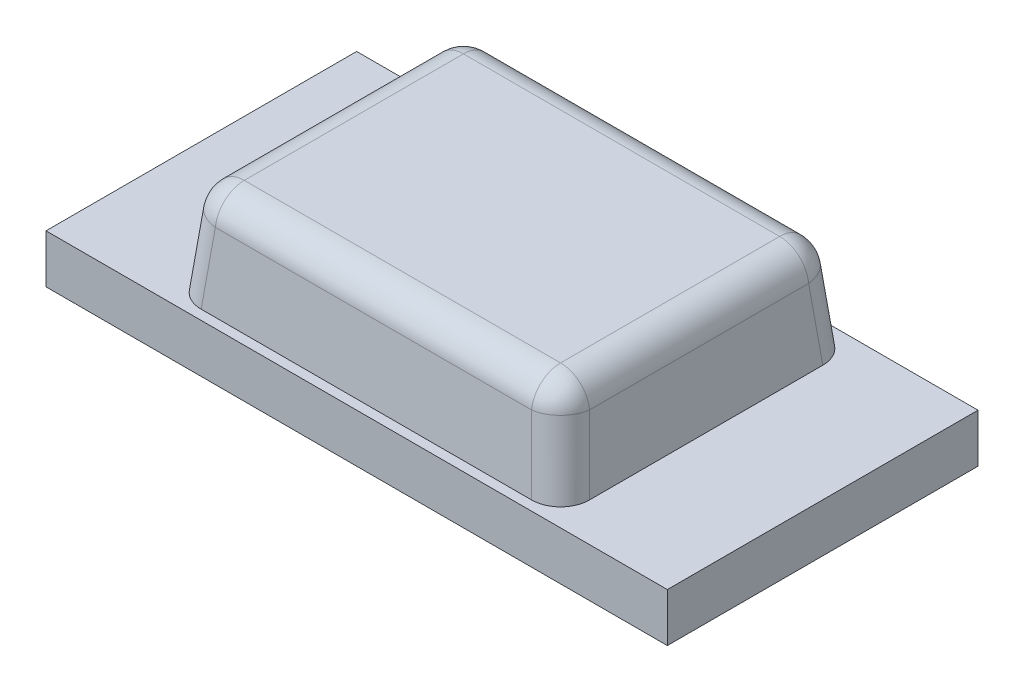
ISO-10303-21;
HEADER;
FILE_DESCRIPTION(('STEP AP214'),'2;1');
FILE_NAME('part.step','',(''),(''),'','','');
FILE_SCHEMA(('AUTOMOTIVE_DESIGN { 1 0 10303 214 1 1 1 1 }'));
ENDSEC;
DATA;
#1=APPLICATION_CONTEXT('core data for automotive mechanical design processes');
#2=APPLICATION_PROTOCOL_DEFINITION('international standard','automotive_design',2000,#1);
#3=PRODUCT_CONTEXT('',#1,'mechanical');
#4=PRODUCT('Part','Part','',(#3));
#5=PRODUCT_RELATED_PRODUCT_CATEGORY('part','',(#4));
#6=PRODUCT_DEFINITION_FORMATION('','',#4);
#7=PRODUCT_DEFINITION_CONTEXT('part definition',#1,'design');
#8=PRODUCT_DEFINITION('design','',#6,#7);
#9=PRODUCT_DEFINITION_SHAPE('','',#8);
#10=(LENGTH_UNIT() NAMED_UNIT(*) SI_UNIT(.MILLI.,.METRE.));
#11=(NAMED_UNIT(*) PLANE_ANGLE_UNIT() SI_UNIT($,.RADIAN.));
#12=(NAMED_UNIT(*) SI_UNIT($,.STERADIAN.) SOLID_ANGLE_UNIT());
#13=UNCERTAINTY_MEASURE_WITH_UNIT(LENGTH_MEASURE(1.E-05),#10,'distance_accuracy_value','');
#14=(GEOMETRIC_REPRESENTATION_CONTEXT(3) GLOBAL_UNCERTAINTY_ASSIGNED_CONTEXT((#13)) GLOBAL_UNIT_ASSIGNED_CONTEXT((#10,
#11,#12)) REPRESENTATION_CONTEXT('',''));
#15=CARTESIAN_POINT('',(0.,0.,0.));
#16=DIRECTION('',(0.,0.,1.));
#17=DIRECTION('',(1.,0.,0.));
#18=AXIS2_PLACEMENT_3D('',#15,#16,#17);
#19=CARTESIAN_POINT('',(0.,0.25,0.));
#20=DIRECTION('',(0.,-1.,0.));
#21=DIRECTION('',(0.,0.,-1.));
#22=AXIS2_PLACEMENT_3D('',#19,#20,#21);
#23=PLANE('',#22);
#24=DIRECTION('',(0.,0.,-1.));
#25=VECTOR('',#24,1.);
#26=CARTESIAN_POINT('',(1.6,0.25,0.799999999999998));
#27=LINE('',#26,#25);
#28=CARTESIAN_POINT('',(1.6,0.25,0.799999999999998));
#29=VERTEX_POINT('',#28);
#30=CARTESIAN_POINT('',(1.6,0.25,-0.800000000000002));
#31=VERTEX_POINT('',#30);
#32=EDGE_CURVE('E147',#29,#31,#27,.T.);
#33=ORIENTED_EDGE('',*,*,#32,.T.);
#34=DIRECTION('',(-1.,0.,0.));
#35=VECTOR('',#34,1.);
#36=CARTESIAN_POINT('',(-1.6,0.25,-0.800000000000002));
#37=LINE('',#36,#35);
#38=CARTESIAN_POINT('',(-1.6,0.25,-0.800000000000002));
#39=VERTEX_POINT('',#38);
#40=EDGE_CURVE('E136',#31,#39,#37,.T.);
#41=ORIENTED_EDGE('',*,*,#40,.T.);
#42=DIRECTION('',(0.,0.,1.));
#43=VECTOR('',#42,1.);
#44=CARTESIAN_POINT('',(-1.6,0.25,0.799999999999998));
#45=LINE('',#44,#43);
#46=CARTESIAN_POINT('',(-1.6,0.25,0.799999999999998));
#47=VERTEX_POINT('',#46);
#48=EDGE_CURVE('E146',#39,#47,#45,.T.);
#49=ORIENTED_EDGE('',*,*,#48,.T.);
#50=DIRECTION('',(1.,0.,0.));
#51=VECTOR('',#50,1.);
#52=CARTESIAN_POINT('',(-1.6,0.25,0.799999999999998));
#53=LINE('',#52,#51);
#54=EDGE_CURVE('E152',#47,#29,#53,.T.);
#55=ORIENTED_EDGE('',*,*,#54,.T.);
#56=EDGE_LOOP('',(#33,#41,#49,#55));
#57=FACE_BOUND('',#56,.T.);
#58=DIRECTION('',(0.,0.,-1.));
#59=VECTOR('',#58,1.);
#60=CARTESIAN_POINT('',(1.,0.25,0.750000000000002));
#61=LINE('',#60,#59);
#62=CARTESIAN_POINT('',(1.,0.25,0.600744266964108));
#63=VERTEX_POINT('',#62);
#64=CARTESIAN_POINT('',(1.,0.25,-0.600744266964107));
#65=VERTEX_POINT('',#64);
#66=EDGE_CURVE('E236',#63,#65,#61,.T.);
#67=ORIENTED_EDGE('',*,*,#66,.F.);
#68=CARTESIAN_POINT('',(0.849252021732466,0.25,0.599252021732468));
#69=DIRECTION('',(0.,-1.,0.));
#70=DIRECTION('',(0.707106781186548,0.,0.707106781186548));
#71=AXIS2_PLACEMENT_3D('',#68,#69,#70);
#72=ELLIPSE('',#71,0.151492263510379,0.15);
#73=CARTESIAN_POINT('',(0.850744266964105,0.25,0.750000000000002));
#74=VERTEX_POINT('',#73);
#75=EDGE_CURVE('E43',#63,#74,#72,.T.);
#76=ORIENTED_EDGE('',*,*,#75,.T.);
#77=DIRECTION('',(1.,0.,0.));
#78=VECTOR('',#77,1.);
#79=CARTESIAN_POINT('',(-1.,0.25,0.750000000000002));
#80=LINE('',#79,#78);
#81=CARTESIAN_POINT('',(-0.850744266964105,0.25,0.750000000000002));
#82=VERTEX_POINT('',#81);
#83=EDGE_CURVE('E247',#82,#74,#80,.T.);
#84=ORIENTED_EDGE('',*,*,#83,.F.);
#85=CARTESIAN_POINT('',(-0.849252021732466,0.25,0.599252021732468));
#86=DIRECTION('',(0.,-1.,0.));
#87=DIRECTION('',(-0.707106781186548,0.,0.707106781186548));
#88=AXIS2_PLACEMENT_3D('',#85,#86,#87);
#89=ELLIPSE('',#88,0.151492263510379,0.15);
#90=CARTESIAN_POINT('',(-1.,0.25,0.600744266964108));
#91=VERTEX_POINT('',#90);
#92=EDGE_CURVE('E11',#82,#91,#89,.T.);
#93=ORIENTED_EDGE('',*,*,#92,.T.);
#94=DIRECTION('',(0.,0.,1.));
#95=VECTOR('',#94,1.);
#96=CARTESIAN_POINT('',(-1.,0.25,0.750000000000002));
#97=LINE('',#96,#95);
#98=CARTESIAN_POINT('',(-1.,0.25,-0.600744266964107));
#99=VERTEX_POINT('',#98);
#100=EDGE_CURVE('E242',#99,#91,#97,.T.);
#101=ORIENTED_EDGE('',*,*,#100,.F.);
#102=CARTESIAN_POINT('',(-0.849252021732466,0.25,-0.599252021732468));
#103=DIRECTION('',(0.,-1.,0.));
#104=DIRECTION('',(-0.707106781186548,0.,-0.707106781186548));
#105=AXIS2_PLACEMENT_3D('',#102,#103,#104);
#106=ELLIPSE('',#105,0.151492263510379,0.15);
#107=CARTESIAN_POINT('',(-0.850744266964105,0.25,-0.750000000000002));
#108=VERTEX_POINT('',#107);
#109=EDGE_CURVE('E198',#99,#108,#106,.T.);
#110=ORIENTED_EDGE('',*,*,#109,.T.);
#111=DIRECTION('',(-1.,0.,0.));
#112=VECTOR('',#111,1.);
#113=CARTESIAN_POINT('',(-1.,0.25,-0.750000000000002));
#114=LINE('',#113,#112);
#115=CARTESIAN_POINT('',(0.850744266964105,0.25,-0.750000000000002));
#116=VERTEX_POINT('',#115);
#117=EDGE_CURVE('E238',#116,#108,#114,.T.);
#118=ORIENTED_EDGE('',*,*,#117,.F.);
#119=CARTESIAN_POINT('',(0.849252021732466,0.25,-0.599252021732468));
#120=DIRECTION('',(0.,-1.,0.));
#121=DIRECTION('',(0.707106781186548,0.,-0.707106781186548));
#122=AXIS2_PLACEMENT_3D('',#119,#120,#121);
#123=ELLIPSE('',#122,0.151492263510379,0.15);
#124=EDGE_CURVE('E200',#116,#65,#123,.T.);
#125=ORIENTED_EDGE('',*,*,#124,.T.);
#126=EDGE_LOOP('',(#67,#76,#84,#93,#101,#110,#118,#125));
#127=FACE_BOUND('',#126,.T.);
#128=ADVANCED_FACE('F34',(#57,#127),#23,.F.);
#129=CARTESIAN_POINT('',(1.6,0.25,0.799999999999998));
#130=DIRECTION('',(-1.,0.,0.));
#131=DIRECTION('',(0.,0.,1.));
#132=AXIS2_PLACEMENT_3D('',#129,#130,#131);
#133=PLANE('',#132);
#134=DIRECTION('',(0.,0.,-1.));
#135=VECTOR('',#134,1.);
#136=CARTESIAN_POINT('',(1.6,0.,0.799999999999998));
#137=LINE('',#136,#135);
#138=CARTESIAN_POINT('',(1.6,0.,0.799999999999998));
#139=VERTEX_POINT('',#138);
#140=CARTESIAN_POINT('',(1.6,0.,-0.800000000000002));
#141=VERTEX_POINT('',#140);
#142=EDGE_CURVE('E160',#139,#141,#137,.T.);
#143=ORIENTED_EDGE('',*,*,#142,.T.);
#144=DIRECTION('',(0.,-1.,0.));
#145=VECTOR('',#144,1.);
#146=CARTESIAN_POINT('',(1.6,0.25,-0.800000000000002));
#147=LINE('',#146,#145);
#148=EDGE_CURVE('E140',#31,#141,#147,.T.);
#149=ORIENTED_EDGE('',*,*,#148,.F.);
#150=ORIENTED_EDGE('',*,*,#32,.F.);
#151=DIRECTION('',(0.,-1.,0.));
#152=VECTOR('',#151,1.);
#153=CARTESIAN_POINT('',(1.6,0.25,0.799999999999998));
#154=LINE('',#153,#152);
#155=EDGE_CURVE('E252',#29,#139,#154,.T.);
#156=ORIENTED_EDGE('',*,*,#155,.T.);
#157=EDGE_LOOP('',(#143,#149,#150,#156));
#158=FACE_BOUND('',#157,.T.);
#159=ADVANCED_FACE('F158',(#158),#133,.F.);
#160=CARTESIAN_POINT('',(-1.6,0.25,-0.800000000000002));
#161=DIRECTION('',(0.,0.,1.));
#162=DIRECTION('',(1.,0.,0.));
#163=AXIS2_PLACEMENT_3D('',#160,#161,#162);
#164=PLANE('',#163);
#165=DIRECTION('',(-1.,0.,0.));
#166=VECTOR('',#165,1.);
#167=CARTESIAN_POINT('',(-1.6,0.,-0.800000000000002));
#168=LINE('',#167,#166);
#169=CARTESIAN_POINT('',(-1.6,0.,-0.800000000000002));
#170=VERTEX_POINT('',#169);
#171=EDGE_CURVE('E254',#141,#170,#168,.T.);
#172=ORIENTED_EDGE('',*,*,#171,.T.);
#173=DIRECTION('',(0.,-1.,0.));
#174=VECTOR('',#173,1.);
#175=CARTESIAN_POINT('',(-1.6,0.25,-0.800000000000002));
#176=LINE('',#175,#174);
#177=EDGE_CURVE('E143',#39,#170,#176,.T.);
#178=ORIENTED_EDGE('',*,*,#177,.F.);
#179=ORIENTED_EDGE('',*,*,#40,.F.);
#180=ORIENTED_EDGE('',*,*,#148,.T.);
#181=EDGE_LOOP('',(#172,#178,#179,#180));
#182=FACE_BOUND('',#181,.T.);
#183=ADVANCED_FACE('F138',(#182),#164,.F.);
#184=CARTESIAN_POINT('',(-1.6,0.25,0.799999999999998));
#185=DIRECTION('',(1.,0.,0.));
#186=DIRECTION('',(0.,0.,-1.));
#187=AXIS2_PLACEMENT_3D('',#184,#185,#186);
#188=PLANE('',#187);
#189=DIRECTION('',(0.,0.,1.));
#190=VECTOR('',#189,1.);
#191=CARTESIAN_POINT('',(-1.6,0.,0.799999999999998));
#192=LINE('',#191,#190);
#193=CARTESIAN_POINT('',(-1.6,0.,0.799999999999998));
#194=VERTEX_POINT('',#193);
#195=EDGE_CURVE('E256',#170,#194,#192,.T.);
#196=ORIENTED_EDGE('',*,*,#195,.T.);
#197=DIRECTION('',(0.,-1.,0.));
#198=VECTOR('',#197,1.);
#199=CARTESIAN_POINT('',(-1.6,0.25,0.799999999999998));
#200=LINE('',#199,#198);
#201=EDGE_CURVE('E165',#47,#194,#200,.T.);
#202=ORIENTED_EDGE('',*,*,#201,.F.);
#203=ORIENTED_EDGE('',*,*,#48,.F.);
#204=ORIENTED_EDGE('',*,*,#177,.T.);
#205=EDGE_LOOP('',(#196,#202,#203,#204));
#206=FACE_BOUND('',#205,.T.);
#207=ADVANCED_FACE('F268',(#206),#188,.F.);
#208=CARTESIAN_POINT('',(-1.6,0.25,0.799999999999998));
#209=DIRECTION('',(0.,0.,-1.));
#210=DIRECTION('',(-1.,0.,0.));
#211=AXIS2_PLACEMENT_3D('',#208,#209,#210);
#212=PLANE('',#211);
#213=DIRECTION('',(1.,0.,0.));
#214=VECTOR('',#213,1.);
#215=CARTESIAN_POINT('',(-1.6,0.,0.799999999999998));
#216=LINE('',#215,#214);
#217=EDGE_CURVE('E156',#194,#139,#216,.T.);
#218=ORIENTED_EDGE('',*,*,#217,.T.);
#219=ORIENTED_EDGE('',*,*,#155,.F.);
#220=ORIENTED_EDGE('',*,*,#54,.F.);
#221=ORIENTED_EDGE('',*,*,#201,.T.);
#222=EDGE_LOOP('',(#218,#219,#220,#221));
#223=FACE_BOUND('',#222,.T.);
#224=ADVANCED_FACE('F263',(#223),#212,.F.);
#225=CARTESIAN_POINT('',(0.,0.,0.));
#226=DIRECTION('',(0.,-1.,0.));
#227=DIRECTION('',(0.,0.,-1.));
#228=AXIS2_PLACEMENT_3D('',#225,#226,#227);
#229=PLANE('',#228);
#230=ORIENTED_EDGE('',*,*,#142,.F.);
#231=ORIENTED_EDGE('',*,*,#217,.F.);
#232=ORIENTED_EDGE('',*,*,#195,.F.);
#233=ORIENTED_EDGE('',*,*,#171,.F.);
#234=EDGE_LOOP('',(#230,#231,#232,#233));
#235=FACE_BOUND('',#234,.T.);
#236=ADVANCED_FACE('F267',(#235),#229,.T.);
#237=CARTESIAN_POINT('',(1.,0.25,0.750000000000002));
#238=DIRECTION('',(0.995038220239298,0.0994934181893926,0.));
#239=DIRECTION('',(-0.0994934181893926,0.995038220239299,0.));
#240=AXIS2_PLACEMENT_3D('',#237,#238,#239);
#241=PLANE('',#240);
#242=ORIENTED_EDGE('',*,*,#66,.T.);
#243=DIRECTION('',(-0.0990046045615373,0.990149572817778,0.0990046045615372));
#244=VECTOR('',#243,1.);
#245=CARTESIAN_POINT('',(0.986760123932997,0.382412605352665,-0.587504390897104));
#246=LINE('',#245,#244);
#247=CARTESIAN_POINT('',(0.96351141426808,0.614924012728409,-0.564255681232188));
#248=VERTEX_POINT('',#247);
#249=EDGE_CURVE('E51',#65,#248,#246,.T.);
#250=ORIENTED_EDGE('',*,*,#249,.T.);
#251=DIRECTION('',(0.,0.,-1.));
#252=VECTOR('',#251,1.);
#253=CARTESIAN_POINT('',(0.96351141426808,0.614924012728409,0.750000000000002));
#254=LINE('',#253,#252);
#255=CARTESIAN_POINT('',(0.96351141426808,0.614924012728409,0.564255681232188));
#256=VERTEX_POINT('',#255);
#257=EDGE_CURVE('E56',#248,#256,#254,.F.);
#258=ORIENTED_EDGE('',*,*,#257,.T.);
#259=DIRECTION('',(-0.0990046045615373,0.990149572817778,-0.0990046045615372));
#260=VECTOR('',#259,1.);
#261=CARTESIAN_POINT('',(1.00146299151958,0.235368554982266,0.602207258483684));
#262=LINE('',#261,#260);
#263=EDGE_CURVE('E194',#256,#63,#262,.F.);
#264=ORIENTED_EDGE('',*,*,#263,.T.);
#265=EDGE_LOOP('',(#242,#250,#258,#264));
#266=FACE_BOUND('',#265,.T.);
#267=ADVANCED_FACE('F288',(#266),#241,.T.);
#268=CARTESIAN_POINT('',(-1.,0.25,-0.750000000000002));
#269=DIRECTION('',(0.,0.0994934181893926,-0.995038220239298));
#270=DIRECTION('',(0.,0.995038220239299,0.0994934181893926));
#271=AXIS2_PLACEMENT_3D('',#268,#269,#270);
#272=PLANE('',#271);
#273=ORIENTED_EDGE('',*,*,#117,.T.);
#274=DIRECTION('',(0.0990046045615372,0.990149572817778,0.0990046045615372));
#275=VECTOR('',#274,1.);
#276=CARTESIAN_POINT('',(-0.852207258483682,0.235368554982266,-0.751462991519579));
#277=LINE('',#276,#275);
#278=CARTESIAN_POINT('',(-0.814255681232185,0.614924012728409,-0.713511414268082));
#279=VERTEX_POINT('',#278);
#280=EDGE_CURVE('E192',#108,#279,#277,.T.);
#281=ORIENTED_EDGE('',*,*,#280,.T.);
#282=DIRECTION('',(-1.,0.,0.));
#283=VECTOR('',#282,1.);
#284=CARTESIAN_POINT('',(-1.,0.614924012728409,-0.713511414268082));
#285=LINE('',#284,#283);
#286=CARTESIAN_POINT('',(0.814255681232186,0.614924012728409,-0.713511414268082));
#287=VERTEX_POINT('',#286);
#288=EDGE_CURVE('E190',#279,#287,#285,.F.);
#289=ORIENTED_EDGE('',*,*,#288,.T.);
#290=DIRECTION('',(-0.0990046045615372,0.990149572817778,0.0990046045615372));
#291=VECTOR('',#290,1.);
#292=CARTESIAN_POINT('',(0.832603435034909,0.431427288809464,-0.731859168070806));
#293=LINE('',#292,#291);
#294=EDGE_CURVE('E188',#287,#116,#293,.F.);
#295=ORIENTED_EDGE('',*,*,#294,.T.);
#296=EDGE_LOOP('',(#273,#281,#289,#295));
#297=FACE_BOUND('',#296,.T.);
#298=ADVANCED_FACE('F285',(#297),#272,.T.);
#299=CARTESIAN_POINT('',(-1.,0.25,0.750000000000002));
#300=DIRECTION('',(-0.995038220239298,0.0994934181893926,0.));
#301=DIRECTION('',(-0.0994934181893926,-0.995038220239299,0.));
#302=AXIS2_PLACEMENT_3D('',#299,#300,#301);
#303=PLANE('',#302);
#304=DIRECTION('',(0.,0.,1.));
#305=VECTOR('',#304,1.);
#306=CARTESIAN_POINT('',(-0.96351141426808,0.614924012728409,0.750000000000002));
#307=LINE('',#306,#305);
#308=CARTESIAN_POINT('',(-0.96351141426808,0.614924012728409,0.564255681232188));
#309=VERTEX_POINT('',#308);
#310=CARTESIAN_POINT('',(-0.96351141426808,0.614924012728409,-0.564255681232188));
#311=VERTEX_POINT('',#310);
#312=EDGE_CURVE('E184',#309,#311,#307,.F.);
#313=ORIENTED_EDGE('',*,*,#312,.T.);
#314=DIRECTION('',(0.0990046045615373,0.990149572817778,0.0990046045615372));
#315=VECTOR('',#314,1.);
#316=CARTESIAN_POINT('',(-0.986760123932997,0.382412605352665,-0.587504390897105));
#317=LINE('',#316,#315);
#318=EDGE_CURVE('E186',#311,#99,#317,.F.);
#319=ORIENTED_EDGE('',*,*,#318,.T.);
#320=ORIENTED_EDGE('',*,*,#100,.T.);
#321=DIRECTION('',(0.0990046045615373,0.990149572817778,-0.0990046045615372));
#322=VECTOR('',#321,1.);
#323=CARTESIAN_POINT('',(-1.00146299151958,0.235368554982266,0.602207258483684));
#324=LINE('',#323,#322);
#325=EDGE_CURVE('E182',#91,#309,#324,.T.);
#326=ORIENTED_EDGE('',*,*,#325,.T.);
#327=EDGE_LOOP('',(#313,#319,#320,#326));
#328=FACE_BOUND('',#327,.T.);
#329=ADVANCED_FACE('F296',(#328),#303,.T.);
#330=CARTESIAN_POINT('',(-1.,0.25,0.750000000000002));
#331=DIRECTION('',(0.,0.0994934181893926,0.995038220239298));
#332=DIRECTION('',(0.,-0.995038220239299,0.0994934181893926));
#333=AXIS2_PLACEMENT_3D('',#330,#331,#332);
#334=PLANE('',#333);
#335=ORIENTED_EDGE('',*,*,#83,.T.);
#336=DIRECTION('',(-0.0990046045615372,0.990149572817778,-0.0990046045615372));
#337=VECTOR('',#336,1.);
#338=CARTESIAN_POINT('',(0.832603435034909,0.431427288809464,0.731859168070806));
#339=LINE('',#338,#337);
#340=CARTESIAN_POINT('',(0.814255681232185,0.614924012728409,0.713511414268082));
#341=VERTEX_POINT('',#340);
#342=EDGE_CURVE('E180',#74,#341,#339,.T.);
#343=ORIENTED_EDGE('',*,*,#342,.T.);
#344=DIRECTION('',(1.,0.,0.));
#345=VECTOR('',#344,1.);
#346=CARTESIAN_POINT('',(-1.,0.614924012728409,0.713511414268082));
#347=LINE('',#346,#345);
#348=CARTESIAN_POINT('',(-0.814255681232185,0.614924012728409,0.713511414268082));
#349=VERTEX_POINT('',#348);
#350=EDGE_CURVE('E177',#341,#349,#347,.F.);
#351=ORIENTED_EDGE('',*,*,#350,.T.);
#352=DIRECTION('',(0.0990046045615372,0.990149572817778,-0.0990046045615372));
#353=VECTOR('',#352,1.);
#354=CARTESIAN_POINT('',(-0.852207258483682,0.235368554982266,0.751462991519579));
#355=LINE('',#354,#353);
#356=EDGE_CURVE('E175',#349,#82,#355,.F.);
#357=ORIENTED_EDGE('',*,*,#356,.T.);
#358=EDGE_LOOP('',(#335,#343,#351,#357));
#359=FACE_BOUND('',#358,.T.);
#360=ADVANCED_FACE('F301',(#359),#334,.T.);
#361=CARTESIAN_POINT('',(0.,0.75,0.));
#362=DIRECTION('',(0.,-1.,0.));
#363=DIRECTION('',(0.,0.,-1.));
#364=AXIS2_PLACEMENT_3D('',#361,#362,#363);
#365=PLANE('',#364);
#366=DIRECTION('',(0.,0.,-1.));
#367=VECTOR('',#366,1.);
#368=CARTESIAN_POINT('',(-0.814255681232185,0.75,0.));
#369=LINE('',#368,#367);
#370=CARTESIAN_POINT('',(-0.814255681232185,0.75,-0.564255681232187));
#371=VERTEX_POINT('',#370);
#372=CARTESIAN_POINT('',(-0.814255681232185,0.75,0.564255681232188));
#373=VERTEX_POINT('',#372);
#374=EDGE_CURVE('E170',#371,#373,#369,.F.);
#375=ORIENTED_EDGE('',*,*,#374,.T.);
#376=DIRECTION('',(-1.,0.,0.));
#377=VECTOR('',#376,1.);
#378=CARTESIAN_POINT('',(0.,0.75,0.564255681232188));
#379=LINE('',#378,#377);
#380=CARTESIAN_POINT('',(0.814255681232185,0.75,0.564255681232188));
#381=VERTEX_POINT('',#380);
#382=EDGE_CURVE('E172',#373,#381,#379,.F.);
#383=ORIENTED_EDGE('',*,*,#382,.T.);
#384=DIRECTION('',(0.,0.,1.));
#385=VECTOR('',#384,1.);
#386=CARTESIAN_POINT('',(0.814255681232185,0.75,0.));
#387=LINE('',#386,#385);
#388=CARTESIAN_POINT('',(0.814255681232185,0.75,-0.564255681232187));
#389=VERTEX_POINT('',#388);
#390=EDGE_CURVE('E161',#381,#389,#387,.F.);
#391=ORIENTED_EDGE('',*,*,#390,.T.);
#392=DIRECTION('',(1.,0.,0.));
#393=VECTOR('',#392,1.);
#394=CARTESIAN_POINT('',(0.,0.75,-0.564255681232187));
#395=LINE('',#394,#393);
#396=EDGE_CURVE('E163',#389,#371,#395,.F.);
#397=ORIENTED_EDGE('',*,*,#396,.T.);
#398=EDGE_LOOP('',(#375,#383,#391,#397));
#399=FACE_BOUND('',#398,.T.);
#400=ADVANCED_FACE('F300',(#399),#365,.F.);
#401=CARTESIAN_POINT('',(-0.837504390897102,0.367488592624256,-0.587504390897104));
#402=DIRECTION('',(-0.0990046045615372,-0.990149572817777,-0.0990046045615372));
#403=DIRECTION('',(0.,0.0994934181893926,-0.995038220239299));
#404=AXIS2_PLACEMENT_3D('',#401,#402,#403);
#405=CYLINDRICAL_SURFACE('',#404,0.15);
#406=ORIENTED_EDGE('',*,*,#109,.F.);
#407=ORIENTED_EDGE('',*,*,#318,.F.);
#408=CARTESIAN_POINT('',(-0.814255681232185,0.6,-0.564255681232187));
#409=DIRECTION('',(0.0990046045615369,0.990149572817778,0.099004604561537));
#410=DIRECTION('',(0.,-0.0994934181893923,0.995038220239299));
#411=AXIS2_PLACEMENT_3D('',#408,#409,#410);
#412=CIRCLE('',#411,0.15);
#413=EDGE_CURVE('E38',#279,#311,#412,.T.);
#414=ORIENTED_EDGE('',*,*,#413,.F.);
#415=ORIENTED_EDGE('',*,*,#280,.F.);
#416=EDGE_LOOP('',(#406,#407,#414,#415));
#417=FACE_BOUND('',#416,.T.);
#418=ADVANCED_FACE('F36',(#417),#405,.T.);
#419=CARTESIAN_POINT('',(0.,0.6,-0.564255681232187));
#420=DIRECTION('',(1.,0.,0.));
#421=DIRECTION('',(0.,0.,-1.));
#422=AXIS2_PLACEMENT_3D('',#419,#420,#421);
#423=CYLINDRICAL_SURFACE('',#422,0.15);
#424=CARTESIAN_POINT('',(0.814255681232186,0.6,-0.564255681232187));
#425=DIRECTION('',(1.,0.,0.));
#426=DIRECTION('',(0.,1.,0.));
#427=AXIS2_PLACEMENT_3D('',#424,#425,#426);
#428=CIRCLE('',#427,0.15);
#429=EDGE_CURVE('E228',#287,#389,#428,.T.);
#430=ORIENTED_EDGE('',*,*,#429,.F.);
#431=ORIENTED_EDGE('',*,*,#288,.F.);
#432=CARTESIAN_POINT('',(-0.814255681232185,0.6,-0.564255681232187));
#433=DIRECTION('',(-1.,0.,0.));
#434=DIRECTION('',(0.,0.,1.));
#435=AXIS2_PLACEMENT_3D('',#432,#433,#434);
#436=CIRCLE('',#435,0.15);
#437=EDGE_CURVE('E230',#371,#279,#436,.T.);
#438=ORIENTED_EDGE('',*,*,#437,.F.);
#439=ORIENTED_EDGE('',*,*,#396,.F.);
#440=EDGE_LOOP('',(#430,#431,#438,#439));
#441=FACE_BOUND('',#440,.T.);
#442=ADVANCED_FACE('F328',(#441),#423,.T.);
#443=CARTESIAN_POINT('',(0.832603435034909,0.416503276081055,-0.582603435034911));
#444=DIRECTION('',(0.0990046045615372,-0.990149572817777,-0.0990046045615372));
#445=DIRECTION('',(0.,0.0994934181893926,-0.995038220239299));
#446=AXIS2_PLACEMENT_3D('',#443,#444,#445);
#447=CYLINDRICAL_SURFACE('',#446,0.15);
#448=ORIENTED_EDGE('',*,*,#124,.F.);
#449=ORIENTED_EDGE('',*,*,#294,.F.);
#450=CARTESIAN_POINT('',(0.814255681232185,0.6,-0.564255681232188));
#451=DIRECTION('',(-0.099004604561537,0.990149572817778,0.0990046045615369));
#452=DIRECTION('',(-0.995038220239299,-0.0994934181893924,0.));
#453=AXIS2_PLACEMENT_3D('',#450,#451,#452);
#454=CIRCLE('',#453,0.15);
#455=EDGE_CURVE('E225',#248,#287,#454,.T.);
#456=ORIENTED_EDGE('',*,*,#455,.F.);
#457=ORIENTED_EDGE('',*,*,#249,.F.);
#458=EDGE_LOOP('',(#448,#449,#456,#457));
#459=FACE_BOUND('',#458,.T.);
#460=ADVANCED_FACE('F324',(#459),#447,.T.);
#461=CARTESIAN_POINT('',(-0.814255681232185,0.6,-0.564255681232187));
#462=DIRECTION('',(0.,0.,1.));
#463=DIRECTION('',(1.,0.,0.));
#464=AXIS2_PLACEMENT_3D('',#461,#462,#463);
#465=SPHERICAL_SURFACE('',#464,0.15);
#466=ORIENTED_EDGE('',*,*,#437,.T.);
#467=ORIENTED_EDGE('',*,*,#413,.T.);
#468=CARTESIAN_POINT('',(-0.814255681232185,0.6,-0.564255681232188));
#469=DIRECTION('',(0.,0.,-1.));
#470=DIRECTION('',(0.,1.,0.));
#471=AXIS2_PLACEMENT_3D('',#468,#469,#470);
#472=CIRCLE('',#471,0.15);
#473=EDGE_CURVE('E222',#371,#311,#472,.F.);
#474=ORIENTED_EDGE('',*,*,#473,.F.);
#475=EDGE_LOOP('',(#466,#467,#474));
#476=FACE_BOUND('',#475,.T.);
#477=ADVANCED_FACE('F358',(#476),#465,.T.);
#478=CARTESIAN_POINT('',(0.814255681232185,0.6,-0.564255681232187));
#479=DIRECTION('',(0.,0.,1.));
#480=DIRECTION('',(1.,0.,0.));
#481=AXIS2_PLACEMENT_3D('',#478,#479,#480);
#482=SPHERICAL_SURFACE('',#481,0.15);
#483=ORIENTED_EDGE('',*,*,#455,.T.);
#484=ORIENTED_EDGE('',*,*,#429,.T.);
#485=CARTESIAN_POINT('',(0.814255681232185,0.6,-0.564255681232187));
#486=DIRECTION('',(0.,0.,-1.));
#487=DIRECTION('',(-1.,0.,0.));
#488=AXIS2_PLACEMENT_3D('',#485,#486,#487);
#489=CIRCLE('',#488,0.15);
#490=EDGE_CURVE('E219',#248,#389,#489,.F.);
#491=ORIENTED_EDGE('',*,*,#490,.F.);
#492=EDGE_LOOP('',(#483,#484,#491));
#493=FACE_BOUND('',#492,.T.);
#494=ADVANCED_FACE('F330',(#493),#482,.T.);
#495=CARTESIAN_POINT('',(-0.852207258483682,0.220444542253857,0.602207258483684));
#496=DIRECTION('',(-0.0990046045615372,-0.990149572817777,0.0990046045615372));
#497=DIRECTION('',(0.,-0.0994934181893926,-0.995038220239299));
#498=AXIS2_PLACEMENT_3D('',#495,#496,#497);
#499=CYLINDRICAL_SURFACE('',#498,0.15);
#500=ORIENTED_EDGE('',*,*,#92,.F.);
#501=ORIENTED_EDGE('',*,*,#356,.F.);
#502=CARTESIAN_POINT('',(-0.814255681232185,0.6,0.564255681232188));
#503=DIRECTION('',(0.099004604561537,0.990149572817778,-0.099004604561537));
#504=DIRECTION('',(0.,0.0994934181893923,0.995038220239299));
#505=AXIS2_PLACEMENT_3D('',#502,#503,#504);
#506=CIRCLE('',#505,0.15);
#507=EDGE_CURVE('E216',#309,#349,#506,.T.);
#508=ORIENTED_EDGE('',*,*,#507,.F.);
#509=ORIENTED_EDGE('',*,*,#325,.F.);
#510=EDGE_LOOP('',(#500,#501,#508,#509));
#511=FACE_BOUND('',#510,.T.);
#512=ADVANCED_FACE('F352',(#511),#499,.T.);
#513=CARTESIAN_POINT('',(-0.814255681232185,0.6,0.));
#514=DIRECTION('',(0.,0.,-1.));
#515=DIRECTION('',(-1.,0.,0.));
#516=AXIS2_PLACEMENT_3D('',#513,#514,#515);
#517=CYLINDRICAL_SURFACE('',#516,0.15);
#518=ORIENTED_EDGE('',*,*,#473,.T.);
#519=ORIENTED_EDGE('',*,*,#312,.F.);
#520=CARTESIAN_POINT('',(-0.814255681232185,0.6,0.564255681232188));
#521=DIRECTION('',(0.,0.,1.));
#522=DIRECTION('',(1.,0.,0.));
#523=AXIS2_PLACEMENT_3D('',#520,#521,#522);
#524=CIRCLE('',#523,0.15);
#525=EDGE_CURVE('E213',#373,#309,#524,.T.);
#526=ORIENTED_EDGE('',*,*,#525,.F.);
#527=ORIENTED_EDGE('',*,*,#374,.F.);
#528=EDGE_LOOP('',(#518,#519,#526,#527));
#529=FACE_BOUND('',#528,.T.);
#530=ADVANCED_FACE('F356',(#529),#517,.T.);
#531=CARTESIAN_POINT('',(0.814255681232185,0.6,0.));
#532=DIRECTION('',(0.,0.,1.));
#533=DIRECTION('',(1.,0.,0.));
#534=AXIS2_PLACEMENT_3D('',#531,#532,#533);
#535=CYLINDRICAL_SURFACE('',#534,0.15);
#536=ORIENTED_EDGE('',*,*,#490,.T.);
#537=ORIENTED_EDGE('',*,*,#390,.F.);
#538=CARTESIAN_POINT('',(0.814255681232185,0.6,0.564255681232188));
#539=DIRECTION('',(0.,0.,1.));
#540=DIRECTION('',(0.,-1.,0.));
#541=AXIS2_PLACEMENT_3D('',#538,#539,#540);
#542=CIRCLE('',#541,0.15);
#543=EDGE_CURVE('E210',#256,#381,#542,.T.);
#544=ORIENTED_EDGE('',*,*,#543,.F.);
#545=ORIENTED_EDGE('',*,*,#257,.F.);
#546=EDGE_LOOP('',(#536,#537,#544,#545));
#547=FACE_BOUND('',#546,.T.);
#548=ADVANCED_FACE('F334',(#547),#535,.T.);
#549=CARTESIAN_POINT('',(0.852207258483682,0.220444542253857,0.602207258483684));
#550=DIRECTION('',(0.0990046045615372,-0.990149572817777,0.0990046045615372));
#551=DIRECTION('',(0.,-0.0994934181893926,-0.995038220239299));
#552=AXIS2_PLACEMENT_3D('',#549,#550,#551);
#553=CYLINDRICAL_SURFACE('',#552,0.15);
#554=ORIENTED_EDGE('',*,*,#75,.F.);
#555=ORIENTED_EDGE('',*,*,#263,.F.);
#556=CARTESIAN_POINT('',(0.814255681232185,0.6,0.564255681232188));
#557=DIRECTION('',(-0.0990046045615369,0.990149572817778,-0.099004604561537));
#558=DIRECTION('',(0.,0.0994934181893923,0.995038220239299));
#559=AXIS2_PLACEMENT_3D('',#556,#557,#558);
#560=CIRCLE('',#559,0.15);
#561=EDGE_CURVE('E207',#341,#256,#560,.T.);
#562=ORIENTED_EDGE('',*,*,#561,.F.);
#563=ORIENTED_EDGE('',*,*,#342,.F.);
#564=EDGE_LOOP('',(#554,#555,#562,#563));
#565=FACE_BOUND('',#564,.T.);
#566=ADVANCED_FACE('F343',(#565),#553,.T.);
#567=CARTESIAN_POINT('',(-0.814255681232185,0.6,0.564255681232188));
#568=DIRECTION('',(0.,0.,1.));
#569=DIRECTION('',(1.,0.,0.));
#570=AXIS2_PLACEMENT_3D('',#567,#568,#569);
#571=SPHERICAL_SURFACE('',#570,0.15);
#572=ORIENTED_EDGE('',*,*,#525,.T.);
#573=ORIENTED_EDGE('',*,*,#507,.T.);
#574=CARTESIAN_POINT('',(-0.814255681232185,0.6,0.564255681232188));
#575=DIRECTION('',(-1.,0.,0.));
#576=DIRECTION('',(0.,0.,1.));
#577=AXIS2_PLACEMENT_3D('',#574,#575,#576);
#578=CIRCLE('',#577,0.15);
#579=EDGE_CURVE('E205',#373,#349,#578,.F.);
#580=ORIENTED_EDGE('',*,*,#579,.F.);
#581=EDGE_LOOP('',(#572,#573,#580));
#582=FACE_BOUND('',#581,.T.);
#583=ADVANCED_FACE('F354',(#582),#571,.T.);
#584=CARTESIAN_POINT('',(0.814255681232185,0.6,0.564255681232188));
#585=DIRECTION('',(0.,0.,1.));
#586=DIRECTION('',(1.,0.,0.));
#587=AXIS2_PLACEMENT_3D('',#584,#585,#586);
#588=SPHERICAL_SURFACE('',#587,0.15);
#589=ORIENTED_EDGE('',*,*,#561,.T.);
#590=ORIENTED_EDGE('',*,*,#543,.T.);
#591=CARTESIAN_POINT('',(0.814255681232185,0.6,0.564255681232188));
#592=DIRECTION('',(1.,0.,0.));
#593=DIRECTION('',(0.,0.,-1.));
#594=AXIS2_PLACEMENT_3D('',#591,#592,#593);
#595=CIRCLE('',#594,0.15);
#596=EDGE_CURVE('E203',#341,#381,#595,.F.);
#597=ORIENTED_EDGE('',*,*,#596,.F.);
#598=EDGE_LOOP('',(#589,#590,#597));
#599=FACE_BOUND('',#598,.T.);
#600=ADVANCED_FACE('F338',(#599),#588,.T.);
#601=CARTESIAN_POINT('',(0.,0.6,0.564255681232188));
#602=DIRECTION('',(-1.,0.,0.));
#603=DIRECTION('',(0.,0.,1.));
#604=AXIS2_PLACEMENT_3D('',#601,#602,#603);
#605=CYLINDRICAL_SURFACE('',#604,0.15);
#606=ORIENTED_EDGE('',*,*,#579,.T.);
#607=ORIENTED_EDGE('',*,*,#350,.F.);
#608=ORIENTED_EDGE('',*,*,#596,.T.);
#609=ORIENTED_EDGE('',*,*,#382,.F.);
#610=EDGE_LOOP('',(#606,#607,#608,#609));
#611=FACE_BOUND('',#610,.T.);
#612=ADVANCED_FACE('F345',(#611),#605,.T.);
#613=CLOSED_SHELL('',(#128,#159,#183,#207,#224,#236,#267,#298,#329,#360,#400,#418,#442,#460,
#477,#494,#512,#530,#548,#566,#583,#600,#612));
#614=MANIFOLD_SOLID_BREP('B2',#613);
#615=ADVANCED_BREP_SHAPE_REPRESENTATION('',(#18,#614),#14);
#616=SHAPE_DEFINITION_REPRESENTATION(#9,#615);
ENDSEC;
END-ISO-10303-21;
